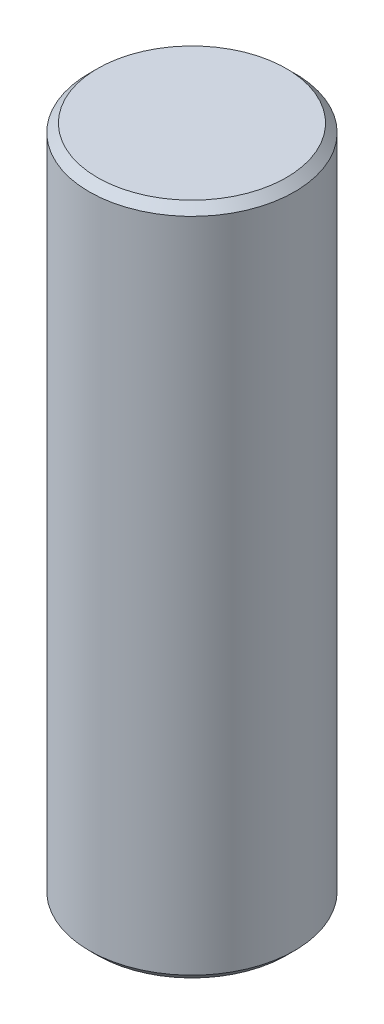
ISO-10303-21;
HEADER;
FILE_DESCRIPTION(('STEP AP214'),'2;1');
FILE_NAME('part.step','',(''),(''),'','','');
FILE_SCHEMA(('AUTOMOTIVE_DESIGN { 1 0 10303 214 1 1 1 1 }'));
ENDSEC;
DATA;
#1=APPLICATION_CONTEXT('core data for automotive mechanical design processes');
#2=APPLICATION_PROTOCOL_DEFINITION('international standard','automotive_design',2000,#1);
#3=PRODUCT_CONTEXT('',#1,'mechanical');
#4=PRODUCT('Part','Part','',(#3));
#5=PRODUCT_RELATED_PRODUCT_CATEGORY('part','',(#4));
#6=PRODUCT_DEFINITION_FORMATION('','',#4);
#7=PRODUCT_DEFINITION_CONTEXT('part definition',#1,'design');
#8=PRODUCT_DEFINITION('design','',#6,#7);
#9=PRODUCT_DEFINITION_SHAPE('','',#8);
#10=(LENGTH_UNIT() NAMED_UNIT(*) SI_UNIT(.MILLI.,.METRE.));
#11=(NAMED_UNIT(*) PLANE_ANGLE_UNIT() SI_UNIT($,.RADIAN.));
#12=(NAMED_UNIT(*) SI_UNIT($,.STERADIAN.) SOLID_ANGLE_UNIT());
#13=UNCERTAINTY_MEASURE_WITH_UNIT(LENGTH_MEASURE(1.E-05),#10,'distance_accuracy_value','');
#14=(GEOMETRIC_REPRESENTATION_CONTEXT(3) GLOBAL_UNCERTAINTY_ASSIGNED_CONTEXT((#13)) GLOBAL_UNIT_ASSIGNED_CONTEXT((#10,
#11,#12)) REPRESENTATION_CONTEXT('',''));
#15=CARTESIAN_POINT('',(0.,0.,0.));
#16=DIRECTION('',(0.,0.,1.));
#17=DIRECTION('',(1.,0.,0.));
#18=AXIS2_PLACEMENT_3D('',#15,#16,#17);
#19=CARTESIAN_POINT('',(0.,82.0000000000001,0.));
#20=DIRECTION('',(0.,-1.,0.));
#21=DIRECTION('',(0.,0.,-0.999999999999999));
#22=AXIS2_PLACEMENT_3D('',#19,#20,#21);
#23=CYLINDRICAL_SURFACE('',#22,12.5);
#24=CARTESIAN_POINT('',(0.,1.,0.));
#25=DIRECTION('',(0.,1.,0.));
#26=DIRECTION('',(0.,0.,0.999999999999999));
#27=AXIS2_PLACEMENT_3D('',#24,#25,#26);
#28=CIRCLE('',#27,12.5);
#29=CARTESIAN_POINT('',(0.,1.,12.5));
#30=VERTEX_POINT('',#29);
#31=EDGE_CURVE('E64',#30,#30,#28,.T.);
#32=ORIENTED_EDGE('',*,*,#31,.T.);
#33=EDGE_LOOP('',(#32));
#34=FACE_BOUND('',#33,.T.);
#35=CARTESIAN_POINT('',(0.,81.0000000000001,0.));
#36=DIRECTION('',(0.,1.,0.));
#37=DIRECTION('',(0.,0.,0.999999999999999));
#38=AXIS2_PLACEMENT_3D('',#35,#36,#37);
#39=CIRCLE('',#38,12.5);
#40=CARTESIAN_POINT('',(0.,81.0000000000001,12.5));
#41=VERTEX_POINT('',#40);
#42=EDGE_CURVE('E70',#41,#41,#39,.F.);
#43=ORIENTED_EDGE('',*,*,#42,.T.);
#44=EDGE_LOOP('',(#43));
#45=FACE_BOUND('',#44,.T.);
#46=ADVANCED_FACE('F50',(#34,#45),#23,.T.);
#47=CARTESIAN_POINT('',(0.,82.0000000000001,0.));
#48=DIRECTION('',(0.,1.,0.));
#49=DIRECTION('',(0.,0.,0.999999999999999));
#50=AXIS2_PLACEMENT_3D('',#47,#48,#49);
#51=PLANE('',#50);
#52=CARTESIAN_POINT('',(0.,82.0000000000001,0.));
#53=DIRECTION('',(0.,1.,0.));
#54=DIRECTION('',(0.,0.,0.999999999999999));
#55=AXIS2_PLACEMENT_3D('',#52,#53,#54);
#56=CIRCLE('',#55,11.5);
#57=CARTESIAN_POINT('',(0.,82.0000000000001,11.5));
#58=VERTEX_POINT('',#57);
#59=EDGE_CURVE('E12',#58,#58,#56,.T.);
#60=ORIENTED_EDGE('',*,*,#59,.T.);
#61=EDGE_LOOP('',(#60));
#62=FACE_BOUND('',#61,.T.);
#63=ADVANCED_FACE('F88',(#62),#51,.T.);
#64=CARTESIAN_POINT('',(0.,0.,0.));
#65=DIRECTION('',(0.,1.,0.));
#66=DIRECTION('',(0.,0.,0.999999999999999));
#67=AXIS2_PLACEMENT_3D('',#64,#65,#66);
#68=PLANE('',#67);
#69=CARTESIAN_POINT('',(0.,0.,0.));
#70=DIRECTION('',(0.,1.,0.));
#71=DIRECTION('',(0.,0.,0.999999999999999));
#72=AXIS2_PLACEMENT_3D('',#69,#70,#71);
#73=CIRCLE('',#72,11.5);
#74=CARTESIAN_POINT('',(0.,0.,11.5));
#75=VERTEX_POINT('',#74);
#76=EDGE_CURVE('E58',#75,#75,#73,.F.);
#77=ORIENTED_EDGE('',*,*,#76,.T.);
#78=EDGE_LOOP('',(#77));
#79=FACE_BOUND('',#78,.T.);
#80=ADVANCED_FACE('F85',(#79),#68,.F.);
#81=CARTESIAN_POINT('',(0.,1.,0.));
#82=DIRECTION('',(0.,1.,0.));
#83=DIRECTION('',(0.,0.,0.999999999999999));
#84=AXIS2_PLACEMENT_3D('',#81,#82,#83);
#85=CONICAL_SURFACE('',#84,12.5,0.785398163397457);
#86=ORIENTED_EDGE('',*,*,#76,.F.);
#87=EDGE_LOOP('',(#86));
#88=FACE_BOUND('',#87,.T.);
#89=ORIENTED_EDGE('',*,*,#31,.F.);
#90=EDGE_LOOP('',(#89));
#91=FACE_BOUND('',#90,.T.);
#92=ADVANCED_FACE('F81',(#88,#91),#85,.T.);
#93=CARTESIAN_POINT('',(0.,82.0000000000001,0.));
#94=DIRECTION('',(0.,-1.,0.));
#95=DIRECTION('',(0.,0.,-0.999999999999999));
#96=AXIS2_PLACEMENT_3D('',#93,#94,#95);
#97=CONICAL_SURFACE('',#96,11.5,0.78539816339745);
#98=ORIENTED_EDGE('',*,*,#42,.F.);
#99=EDGE_LOOP('',(#98));
#100=FACE_BOUND('',#99,.T.);
#101=ORIENTED_EDGE('',*,*,#59,.F.);
#102=EDGE_LOOP('',(#101));
#103=FACE_BOUND('',#102,.T.);
#104=ADVANCED_FACE('F52',(#100,#103),#97,.T.);
#105=CLOSED_SHELL('',(#46,#63,#80,#92,#104));
#106=MANIFOLD_SOLID_BREP('B2',#105);
#107=ADVANCED_BREP_SHAPE_REPRESENTATION('',(#18,#106),#14);
#108=SHAPE_DEFINITION_REPRESENTATION(#9,#107);
ENDSEC;
END-ISO-10303-21;
